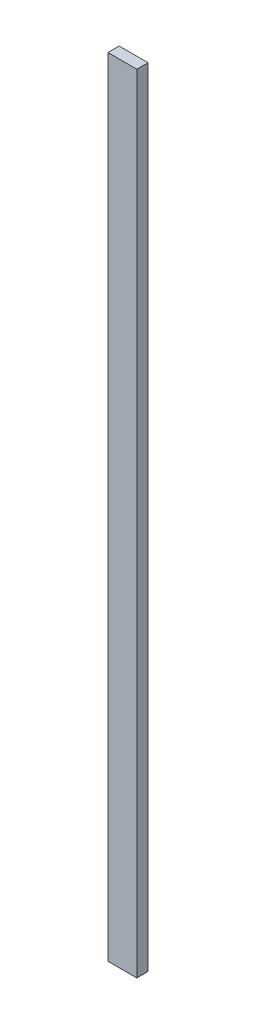
ISO-10303-21;
HEADER;
FILE_DESCRIPTION(('STEP AP214'),'2;1');
FILE_NAME('part.step','',(''),(''),'','','');
FILE_SCHEMA(('AUTOMOTIVE_DESIGN { 1 0 10303 214 1 1 1 1 }'));
ENDSEC;
DATA;
#1=APPLICATION_CONTEXT('core data for automotive mechanical design processes');
#2=APPLICATION_PROTOCOL_DEFINITION('international standard','automotive_design',2000,#1);
#3=PRODUCT_CONTEXT('',#1,'mechanical');
#4=PRODUCT('Part','Part','',(#3));
#5=PRODUCT_RELATED_PRODUCT_CATEGORY('part','',(#4));
#6=PRODUCT_DEFINITION_FORMATION('','',#4);
#7=PRODUCT_DEFINITION_CONTEXT('part definition',#1,'design');
#8=PRODUCT_DEFINITION('design','',#6,#7);
#9=PRODUCT_DEFINITION_SHAPE('','',#8);
#10=(LENGTH_UNIT() NAMED_UNIT(*) SI_UNIT(.MILLI.,.METRE.));
#11=(NAMED_UNIT(*) PLANE_ANGLE_UNIT() SI_UNIT($,.RADIAN.));
#12=(NAMED_UNIT(*) SI_UNIT($,.STERADIAN.) SOLID_ANGLE_UNIT());
#13=UNCERTAINTY_MEASURE_WITH_UNIT(LENGTH_MEASURE(1.E-05),#10,'distance_accuracy_value','');
#14=(GEOMETRIC_REPRESENTATION_CONTEXT(3) GLOBAL_UNCERTAINTY_ASSIGNED_CONTEXT((#13)) GLOBAL_UNIT_ASSIGNED_CONTEXT((#10,
#11,#12)) REPRESENTATION_CONTEXT('',''));
#15=CARTESIAN_POINT('',(0.,0.,0.));
#16=DIRECTION('',(0.,0.,1.));
#17=DIRECTION('',(1.,0.,0.));
#18=AXIS2_PLACEMENT_3D('',#15,#16,#17);
#19=CARTESIAN_POINT('',(-69.5638467870037,644.992464765343,10.));
#20=DIRECTION('',(1.,0.,0.));
#21=DIRECTION('',(0.,1.,0.));
#22=AXIS2_PLACEMENT_3D('',#19,#20,#21);
#23=PLANE('',#22);
#24=DIRECTION('',(0.,-1.,0.));
#25=VECTOR('',#24,1.);
#26=CARTESIAN_POINT('',(-69.5638467870037,644.992464765343,0.));
#27=LINE('',#26,#25);
#28=CARTESIAN_POINT('',(-69.5638467870037,644.992464765343,0.));
#29=VERTEX_POINT('',#28);
#30=CARTESIAN_POINT('',(-69.5638467870036,-55.007535234657,0.));
#31=VERTEX_POINT('',#30);
#32=EDGE_CURVE('E107',#29,#31,#27,.T.);
#33=ORIENTED_EDGE('',*,*,#32,.T.);
#34=DIRECTION('',(0.,0.,-1.));
#35=VECTOR('',#34,1.);
#36=CARTESIAN_POINT('',(-69.5638467870036,-55.007535234657,10.));
#37=LINE('',#36,#35);
#38=CARTESIAN_POINT('',(-69.5638467870036,-55.007535234657,10.));
#39=VERTEX_POINT('',#38);
#40=EDGE_CURVE('E11',#39,#31,#37,.T.);
#41=ORIENTED_EDGE('',*,*,#40,.F.);
#42=DIRECTION('',(0.,-1.,0.));
#43=VECTOR('',#42,1.);
#44=CARTESIAN_POINT('',(-69.5638467870037,644.992464765343,10.));
#45=LINE('',#44,#43);
#46=CARTESIAN_POINT('',(-69.5638467870037,644.992464765343,10.));
#47=VERTEX_POINT('',#46);
#48=EDGE_CURVE('E91',#47,#39,#45,.T.);
#49=ORIENTED_EDGE('',*,*,#48,.F.);
#50=DIRECTION('',(0.,0.,-1.));
#51=VECTOR('',#50,1.);
#52=CARTESIAN_POINT('',(-69.5638467870037,644.992464765343,10.));
#53=LINE('',#52,#51);
#54=EDGE_CURVE('E103',#47,#29,#53,.T.);
#55=ORIENTED_EDGE('',*,*,#54,.T.);
#56=EDGE_LOOP('',(#33,#41,#49,#55));
#57=FACE_BOUND('',#56,.T.);
#58=ADVANCED_FACE('F39',(#57),#23,.F.);
#59=CARTESIAN_POINT('',(-69.5638467870036,-55.007535234657,10.));
#60=DIRECTION('',(0.,1.,0.));
#61=DIRECTION('',(0.,0.,1.));
#62=AXIS2_PLACEMENT_3D('',#59,#60,#61);
#63=PLANE('',#62);
#64=DIRECTION('',(1.,0.,0.));
#65=VECTOR('',#64,1.);
#66=CARTESIAN_POINT('',(-69.5638467870036,-55.007535234657,0.));
#67=LINE('',#66,#65);
#68=CARTESIAN_POINT('',(-43.8221589891697,-55.007535234657,0.));
#69=VERTEX_POINT('',#68);
#70=EDGE_CURVE('E96',#31,#69,#67,.T.);
#71=ORIENTED_EDGE('',*,*,#70,.T.);
#72=DIRECTION('',(0.,0.,-1.));
#73=VECTOR('',#72,1.);
#74=CARTESIAN_POINT('',(-43.8221589891697,-55.007535234657,10.));
#75=LINE('',#74,#73);
#76=CARTESIAN_POINT('',(-43.8221589891697,-55.007535234657,10.));
#77=VERTEX_POINT('',#76);
#78=EDGE_CURVE('E48',#77,#69,#75,.T.);
#79=ORIENTED_EDGE('',*,*,#78,.F.);
#80=DIRECTION('',(1.,0.,0.));
#81=VECTOR('',#80,1.);
#82=CARTESIAN_POINT('',(-69.5638467870036,-55.007535234657,10.));
#83=LINE('',#82,#81);
#84=EDGE_CURVE('E86',#39,#77,#83,.T.);
#85=ORIENTED_EDGE('',*,*,#84,.F.);
#86=ORIENTED_EDGE('',*,*,#40,.T.);
#87=EDGE_LOOP('',(#71,#79,#85,#86));
#88=FACE_BOUND('',#87,.T.);
#89=ADVANCED_FACE('F95',(#88),#63,.F.);
#90=CARTESIAN_POINT('',(-43.8221589891698,644.992464765343,10.));
#91=DIRECTION('',(-1.,0.,0.));
#92=DIRECTION('',(0.,-1.,0.));
#93=AXIS2_PLACEMENT_3D('',#90,#91,#92);
#94=PLANE('',#93);
#95=DIRECTION('',(0.,1.,0.));
#96=VECTOR('',#95,1.);
#97=CARTESIAN_POINT('',(-43.8221589891698,644.992464765343,0.));
#98=LINE('',#97,#96);
#99=CARTESIAN_POINT('',(-43.8221589891698,644.992464765343,0.));
#100=VERTEX_POINT('',#99);
#101=EDGE_CURVE('E73',#69,#100,#98,.T.);
#102=ORIENTED_EDGE('',*,*,#101,.T.);
#103=DIRECTION('',(0.,0.,-1.));
#104=VECTOR('',#103,1.);
#105=CARTESIAN_POINT('',(-43.8221589891698,644.992464765343,10.));
#106=LINE('',#105,#104);
#107=CARTESIAN_POINT('',(-43.8221589891698,644.992464765343,10.));
#108=VERTEX_POINT('',#107);
#109=EDGE_CURVE('E98',#108,#100,#106,.T.);
#110=ORIENTED_EDGE('',*,*,#109,.F.);
#111=DIRECTION('',(0.,1.,0.));
#112=VECTOR('',#111,1.);
#113=CARTESIAN_POINT('',(-43.8221589891698,644.992464765343,10.));
#114=LINE('',#113,#112);
#115=EDGE_CURVE('E89',#77,#108,#114,.T.);
#116=ORIENTED_EDGE('',*,*,#115,.F.);
#117=ORIENTED_EDGE('',*,*,#78,.T.);
#118=EDGE_LOOP('',(#102,#110,#116,#117));
#119=FACE_BOUND('',#118,.T.);
#120=ADVANCED_FACE('F99',(#119),#94,.F.);
#121=CARTESIAN_POINT('',(-69.5638467870037,644.992464765343,10.));
#122=DIRECTION('',(0.,-1.,0.));
#123=DIRECTION('',(0.,0.,-1.));
#124=AXIS2_PLACEMENT_3D('',#121,#122,#123);
#125=PLANE('',#124);
#126=DIRECTION('',(-1.,0.,0.));
#127=VECTOR('',#126,1.);
#128=CARTESIAN_POINT('',(-69.5638467870037,644.992464765343,0.));
#129=LINE('',#128,#127);
#130=EDGE_CURVE('E79',#100,#29,#129,.T.);
#131=ORIENTED_EDGE('',*,*,#130,.T.);
#132=ORIENTED_EDGE('',*,*,#54,.F.);
#133=DIRECTION('',(-1.,0.,0.));
#134=VECTOR('',#133,1.);
#135=CARTESIAN_POINT('',(-69.5638467870037,644.992464765343,10.));
#136=LINE('',#135,#134);
#137=EDGE_CURVE('E56',#108,#47,#136,.T.);
#138=ORIENTED_EDGE('',*,*,#137,.F.);
#139=ORIENTED_EDGE('',*,*,#109,.T.);
#140=EDGE_LOOP('',(#131,#132,#138,#139));
#141=FACE_BOUND('',#140,.T.);
#142=ADVANCED_FACE('F120',(#141),#125,.F.);
#143=CARTESIAN_POINT('',(0.,0.,10.));
#144=DIRECTION('',(0.,0.,1.));
#145=DIRECTION('',(1.,0.,0.));
#146=AXIS2_PLACEMENT_3D('',#143,#144,#145);
#147=PLANE('',#146);
#148=ORIENTED_EDGE('',*,*,#48,.T.);
#149=ORIENTED_EDGE('',*,*,#84,.T.);
#150=ORIENTED_EDGE('',*,*,#115,.T.);
#151=ORIENTED_EDGE('',*,*,#137,.T.);
#152=EDGE_LOOP('',(#148,#149,#150,#151));
#153=FACE_BOUND('',#152,.T.);
#154=ADVANCED_FACE('F87',(#153),#147,.T.);
#155=CARTESIAN_POINT('',(0.,0.,0.));
#156=DIRECTION('',(0.,0.,1.));
#157=DIRECTION('',(1.,0.,0.));
#158=AXIS2_PLACEMENT_3D('',#155,#156,#157);
#159=PLANE('',#158);
#160=ORIENTED_EDGE('',*,*,#32,.F.);
#161=ORIENTED_EDGE('',*,*,#130,.F.);
#162=ORIENTED_EDGE('',*,*,#101,.F.);
#163=ORIENTED_EDGE('',*,*,#70,.F.);
#164=EDGE_LOOP('',(#160,#161,#162,#163));
#165=FACE_BOUND('',#164,.T.);
#166=ADVANCED_FACE('F123',(#165),#159,.F.);
#167=CLOSED_SHELL('',(#58,#89,#120,#142,#154,#166));
#168=MANIFOLD_SOLID_BREP('B2',#167);
#169=ADVANCED_BREP_SHAPE_REPRESENTATION('',(#18,#168),#14);
#170=SHAPE_DEFINITION_REPRESENTATION(#9,#169);
ENDSEC;
END-ISO-10303-21;
